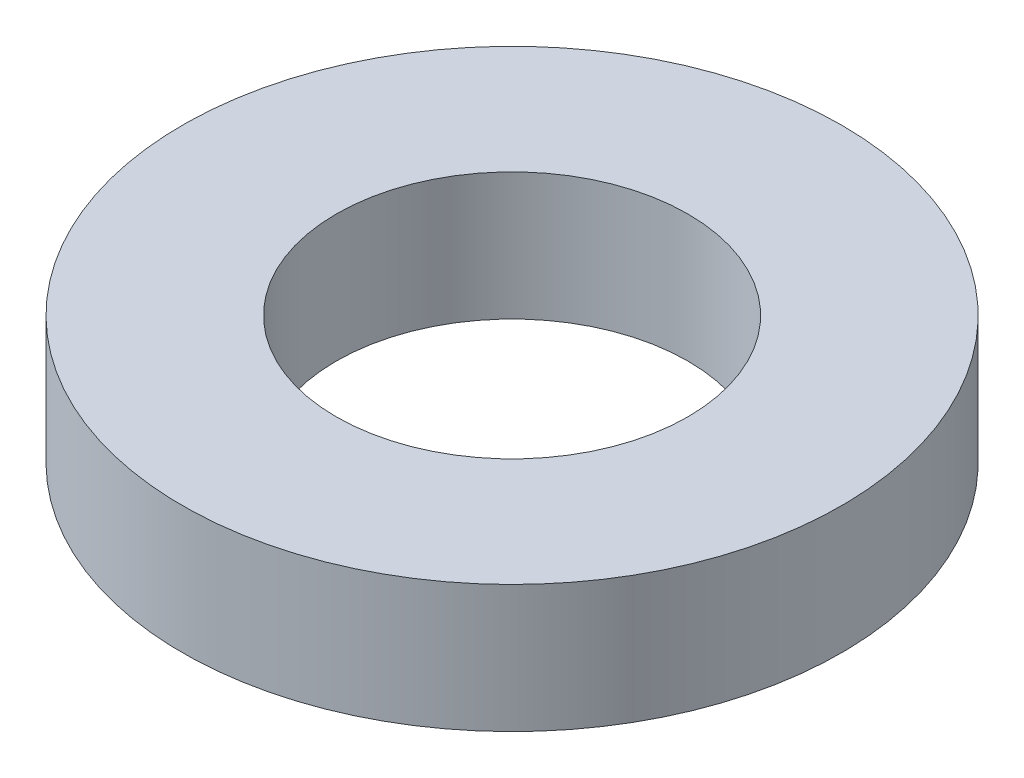
ISO-10303-21;
HEADER;
FILE_DESCRIPTION(('STEP AP214'),'2;1');
FILE_NAME('part.step','',(''),(''),'','','');
FILE_SCHEMA(('AUTOMOTIVE_DESIGN { 1 0 10303 214 1 1 1 1 }'));
ENDSEC;
DATA;
#1=APPLICATION_CONTEXT('core data for automotive mechanical design processes');
#2=APPLICATION_PROTOCOL_DEFINITION('international standard','automotive_design',2000,#1);
#3=PRODUCT_CONTEXT('',#1,'mechanical');
#4=PRODUCT('Part','Part','',(#3));
#5=PRODUCT_RELATED_PRODUCT_CATEGORY('part','',(#4));
#6=PRODUCT_DEFINITION_FORMATION('','',#4);
#7=PRODUCT_DEFINITION_CONTEXT('part definition',#1,'design');
#8=PRODUCT_DEFINITION('design','',#6,#7);
#9=PRODUCT_DEFINITION_SHAPE('','',#8);
#10=(LENGTH_UNIT() NAMED_UNIT(*) SI_UNIT(.MILLI.,.METRE.));
#11=(NAMED_UNIT(*) PLANE_ANGLE_UNIT() SI_UNIT($,.RADIAN.));
#12=(NAMED_UNIT(*) SI_UNIT($,.STERADIAN.) SOLID_ANGLE_UNIT());
#13=UNCERTAINTY_MEASURE_WITH_UNIT(LENGTH_MEASURE(1.E-05),#10,'distance_accuracy_value','');
#14=(GEOMETRIC_REPRESENTATION_CONTEXT(3) GLOBAL_UNCERTAINTY_ASSIGNED_CONTEXT((#13)) GLOBAL_UNIT_ASSIGNED_CONTEXT((#10,
#11,#12)) REPRESENTATION_CONTEXT('',''));
#15=CARTESIAN_POINT('',(0.,0.,0.));
#16=DIRECTION('',(0.,0.,1.));
#17=DIRECTION('',(1.,0.,0.));
#18=AXIS2_PLACEMENT_3D('',#15,#16,#17);
#19=CARTESIAN_POINT('',(0.,29.,0.));
#20=DIRECTION('',(0.,-1.,0.));
#21=DIRECTION('',(0.,0.,-1.));
#22=AXIS2_PLACEMENT_3D('',#19,#20,#21);
#23=CYLINDRICAL_SURFACE('',#22,75.);
#24=CARTESIAN_POINT('',(0.,29.,0.));
#25=DIRECTION('',(0.,1.,0.));
#26=DIRECTION('',(0.,0.,1.));
#27=AXIS2_PLACEMENT_3D('',#24,#25,#26);
#28=CIRCLE('',#27,75.);
#29=CARTESIAN_POINT('',(0.,29.,-75.));
#30=VERTEX_POINT('',#29);
#31=EDGE_CURVE('E10',#30,#30,#28,.T.);
#32=CARTESIAN_POINT('',(0.,0.,0.));
#33=DIRECTION('',(0.,1.,0.));
#34=DIRECTION('',(0.,0.,1.));
#35=AXIS2_PLACEMENT_3D('',#32,#33,#34);
#36=CIRCLE('',#35,75.);
#37=CARTESIAN_POINT('',(0.,0.,-75.));
#38=VERTEX_POINT('',#37);
#39=EDGE_CURVE('E37',#38,#38,#36,.T.);
#40=CARTESIAN_POINT('',(0.,29.,-75.));
#41=CARTESIAN_POINT('',(0.,28.6979166666667,-75.));
#42=CARTESIAN_POINT('',(0.,28.3958333333333,-75.));
#43=CARTESIAN_POINT('',(0.,27.7916666666667,-75.));
#44=CARTESIAN_POINT('',(0.,27.4895833333333,-75.));
#45=CARTESIAN_POINT('',(0.,26.8854166666667,-75.));
#46=CARTESIAN_POINT('',(0.,26.5833333333333,-75.));
#47=CARTESIAN_POINT('',(0.,25.9791666666667,-75.));
#48=CARTESIAN_POINT('',(0.,25.6770833333333,-75.));
#49=CARTESIAN_POINT('',(0.,25.0729166666667,-75.));
#50=CARTESIAN_POINT('',(0.,24.7708333333333,-75.));
#51=CARTESIAN_POINT('',(0.,24.1666666666667,-75.));
#52=CARTESIAN_POINT('',(0.,23.8645833333333,-75.));
#53=CARTESIAN_POINT('',(0.,23.2604166666667,-75.));
#54=CARTESIAN_POINT('',(0.,22.9583333333333,-75.));
#55=CARTESIAN_POINT('',(0.,22.3541666666667,-75.));
#56=CARTESIAN_POINT('',(0.,22.0520833333333,-75.));
#57=CARTESIAN_POINT('',(0.,21.4479166666667,-75.));
#58=CARTESIAN_POINT('',(0.,21.1458333333333,-75.));
#59=CARTESIAN_POINT('',(0.,20.5416666666667,-75.));
#60=CARTESIAN_POINT('',(0.,20.2395833333333,-75.));
#61=CARTESIAN_POINT('',(0.,19.6354166666667,-75.));
#62=CARTESIAN_POINT('',(0.,19.3333333333333,-75.));
#63=CARTESIAN_POINT('',(0.,18.7291666666667,-75.));
#64=CARTESIAN_POINT('',(0.,18.4270833333333,-75.));
#65=CARTESIAN_POINT('',(0.,17.8229166666667,-75.));
#66=CARTESIAN_POINT('',(0.,17.5208333333333,-75.));
#67=CARTESIAN_POINT('',(0.,16.9166666666667,-75.));
#68=CARTESIAN_POINT('',(0.,16.6145833333333,-75.));
#69=CARTESIAN_POINT('',(0.,16.0104166666667,-75.));
#70=CARTESIAN_POINT('',(0.,15.7083333333333,-75.));
#71=CARTESIAN_POINT('',(0.,15.1041666666667,-75.));
#72=CARTESIAN_POINT('',(0.,14.8020833333333,-75.));
#73=CARTESIAN_POINT('',(0.,14.1979166666667,-75.));
#74=CARTESIAN_POINT('',(0.,13.8958333333333,-75.));
#75=CARTESIAN_POINT('',(0.,13.2916666666667,-75.));
#76=CARTESIAN_POINT('',(0.,12.9895833333333,-75.));
#77=CARTESIAN_POINT('',(0.,12.3854166666667,-75.));
#78=CARTESIAN_POINT('',(0.,12.0833333333333,-75.));
#79=CARTESIAN_POINT('',(0.,11.4791666666667,-75.));
#80=CARTESIAN_POINT('',(0.,11.1770833333333,-75.));
#81=CARTESIAN_POINT('',(0.,10.5729166666667,-75.));
#82=CARTESIAN_POINT('',(0.,10.2708333333333,-75.));
#83=CARTESIAN_POINT('',(0.,9.66666666666667,-75.));
#84=CARTESIAN_POINT('',(0.,9.36458333333333,-75.));
#85=CARTESIAN_POINT('',(0.,8.76041666666667,-75.));
#86=CARTESIAN_POINT('',(0.,8.45833333333333,-75.));
#87=CARTESIAN_POINT('',(0.,7.85416666666667,-75.));
#88=CARTESIAN_POINT('',(0.,7.55208333333333,-75.));
#89=CARTESIAN_POINT('',(0.,6.94791666666667,-75.));
#90=CARTESIAN_POINT('',(0.,6.64583333333333,-75.));
#91=CARTESIAN_POINT('',(0.,6.04166666666667,-75.));
#92=CARTESIAN_POINT('',(0.,5.73958333333333,-75.));
#93=CARTESIAN_POINT('',(0.,5.13541666666667,-75.));
#94=CARTESIAN_POINT('',(0.,4.83333333333333,-75.));
#95=CARTESIAN_POINT('',(0.,4.22916666666667,-75.));
#96=CARTESIAN_POINT('',(0.,3.92708333333333,-75.));
#97=CARTESIAN_POINT('',(0.,3.32291666666667,-75.));
#98=CARTESIAN_POINT('',(0.,3.02083333333333,-75.));
#99=CARTESIAN_POINT('',(0.,2.41666666666667,-75.));
#100=CARTESIAN_POINT('',(0.,2.11458333333333,-75.));
#101=CARTESIAN_POINT('',(0.,1.51041666666667,-75.));
#102=CARTESIAN_POINT('',(0.,1.20833333333333,-75.));
#103=CARTESIAN_POINT('',(0.,0.604166666666667,-75.));
#104=CARTESIAN_POINT('',(0.,0.302083333333333,-75.));
#105=CARTESIAN_POINT('',(0.,0.,-75.));
#106=B_SPLINE_CURVE_WITH_KNOTS('',3,(#40,#41,#42,#43,#44,#45,#46,#47,#48,#49,#50,#51,#52,#53,
#54,#55,#56,#57,#58,#59,#60,#61,#62,#63,#64,#65,#66,#67,#68,#69,#70,#71,#72,#73,#74,#75,#76,#77,
#78,#79,#80,#81,#82,#83,#84,#85,#86,#87,#88,#89,#90,#91,#92,#93,#94,#95,#96,#97,#98,#99,#100,
#101,#102,#103,#104,#105),.UNSPECIFIED.,.F.,.F.,(4,2,2,2,2,2,2,2,2,2,2,2,2,2,2,2,2,2,2,2,2,2,2,
2,2,2,2,2,2,2,2,2,4),(0.,0.906250000000001,1.8125,2.71875,3.625,4.53125,5.4375,6.34375,7.25,
8.15625,9.0625,9.96875,10.875,11.78125,12.6875,13.59375,14.5,15.40625,16.3125,17.21875,18.125,
19.03125,19.9375,20.84375,21.75,22.65625,23.5625,24.46875,25.375,26.28125,27.1875,28.09375,29.),.UNSPECIFIED.);
#107=EDGE_CURVE('BSEAM40',#30,#38,#106,.T.);
#108=ORIENTED_EDGE('',*,*,#31,.F.);
#109=ORIENTED_EDGE('',*,*,#39,.T.);
#110=ORIENTED_EDGE('',*,*,#107,.T.);
#111=ORIENTED_EDGE('',*,*,#107,.F.);
#112=EDGE_LOOP('',(#108,#110,#109,#111));
#113=FACE_BOUND('',#112,.T.);
#114=ADVANCED_FACE('F40',(#113),#23,.T.);
#115=CARTESIAN_POINT('',(0.,29.,0.));
#116=DIRECTION('',(0.,1.,0.));
#117=DIRECTION('',(0.,0.,1.));
#118=AXIS2_PLACEMENT_3D('',#115,#116,#117);
#119=PLANE('',#118);
#120=CARTESIAN_POINT('',(0.,29.,0.));
#121=DIRECTION('',(0.,1.,0.));
#122=DIRECTION('',(0.,0.,1.));
#123=AXIS2_PLACEMENT_3D('',#120,#121,#122);
#124=CIRCLE('',#123,40.);
#125=CARTESIAN_POINT('',(0.,29.,-40.));
#126=VERTEX_POINT('',#125);
#127=EDGE_CURVE('E50',#126,#126,#124,.T.);
#128=ORIENTED_EDGE('',*,*,#127,.F.);
#129=EDGE_LOOP('',(#128));
#130=FACE_BOUND('',#129,.T.);
#131=ORIENTED_EDGE('',*,*,#31,.T.);
#132=EDGE_LOOP('',(#131));
#133=FACE_BOUND('',#132,.T.);
#134=ADVANCED_FACE('F59',(#130,#133),#119,.T.);
#135=CARTESIAN_POINT('',(0.,0.,0.));
#136=DIRECTION('',(0.,1.,0.));
#137=DIRECTION('',(0.,0.,1.));
#138=AXIS2_PLACEMENT_3D('',#135,#136,#137);
#139=PLANE('',#138);
#140=CARTESIAN_POINT('',(0.,0.,0.));
#141=DIRECTION('',(0.,1.,0.));
#142=DIRECTION('',(0.,0.,1.));
#143=AXIS2_PLACEMENT_3D('',#140,#141,#142);
#144=CIRCLE('',#143,40.);
#145=CARTESIAN_POINT('',(0.,0.,-40.));
#146=VERTEX_POINT('',#145);
#147=EDGE_CURVE('E47',#146,#146,#144,.T.);
#148=ORIENTED_EDGE('',*,*,#147,.T.);
#149=EDGE_LOOP('',(#148));
#150=FACE_BOUND('',#149,.T.);
#151=ORIENTED_EDGE('',*,*,#39,.F.);
#152=EDGE_LOOP('',(#151));
#153=FACE_BOUND('',#152,.T.);
#154=ADVANCED_FACE('F58',(#150,#153),#139,.F.);
#155=CARTESIAN_POINT('',(0.,29.,0.));
#156=DIRECTION('',(0.,-1.,0.));
#157=DIRECTION('',(0.,0.,-1.));
#158=AXIS2_PLACEMENT_3D('',#155,#156,#157);
#159=CYLINDRICAL_SURFACE('',#158,40.);
#160=CARTESIAN_POINT('',(0.,29.,-40.));
#161=CARTESIAN_POINT('',(0.,28.6979166666667,-40.));
#162=CARTESIAN_POINT('',(0.,28.3958333333333,-40.));
#163=CARTESIAN_POINT('',(0.,27.7916666666667,-40.));
#164=CARTESIAN_POINT('',(0.,27.4895833333333,-40.));
#165=CARTESIAN_POINT('',(0.,26.8854166666667,-40.));
#166=CARTESIAN_POINT('',(0.,26.5833333333333,-40.));
#167=CARTESIAN_POINT('',(0.,25.9791666666667,-40.));
#168=CARTESIAN_POINT('',(0.,25.6770833333333,-40.));
#169=CARTESIAN_POINT('',(0.,25.0729166666667,-40.));
#170=CARTESIAN_POINT('',(0.,24.7708333333333,-40.));
#171=CARTESIAN_POINT('',(0.,24.1666666666667,-40.));
#172=CARTESIAN_POINT('',(0.,23.8645833333333,-40.));
#173=CARTESIAN_POINT('',(0.,23.2604166666667,-40.));
#174=CARTESIAN_POINT('',(0.,22.9583333333333,-40.));
#175=CARTESIAN_POINT('',(0.,22.3541666666667,-40.));
#176=CARTESIAN_POINT('',(0.,22.0520833333333,-40.));
#177=CARTESIAN_POINT('',(0.,21.4479166666667,-40.));
#178=CARTESIAN_POINT('',(0.,21.1458333333333,-40.));
#179=CARTESIAN_POINT('',(0.,20.5416666666667,-40.));
#180=CARTESIAN_POINT('',(0.,20.2395833333333,-40.));
#181=CARTESIAN_POINT('',(0.,19.6354166666667,-40.));
#182=CARTESIAN_POINT('',(0.,19.3333333333333,-40.));
#183=CARTESIAN_POINT('',(0.,18.7291666666667,-40.));
#184=CARTESIAN_POINT('',(0.,18.4270833333333,-40.));
#185=CARTESIAN_POINT('',(0.,17.8229166666667,-40.));
#186=CARTESIAN_POINT('',(0.,17.5208333333333,-40.));
#187=CARTESIAN_POINT('',(0.,16.9166666666667,-40.));
#188=CARTESIAN_POINT('',(0.,16.6145833333333,-40.));
#189=CARTESIAN_POINT('',(0.,16.0104166666667,-40.));
#190=CARTESIAN_POINT('',(0.,15.7083333333333,-40.));
#191=CARTESIAN_POINT('',(0.,15.1041666666667,-40.));
#192=CARTESIAN_POINT('',(0.,14.8020833333333,-40.));
#193=CARTESIAN_POINT('',(0.,14.1979166666667,-40.));
#194=CARTESIAN_POINT('',(0.,13.8958333333333,-40.));
#195=CARTESIAN_POINT('',(0.,13.2916666666667,-40.));
#196=CARTESIAN_POINT('',(0.,12.9895833333333,-40.));
#197=CARTESIAN_POINT('',(0.,12.3854166666667,-40.));
#198=CARTESIAN_POINT('',(0.,12.0833333333333,-40.));
#199=CARTESIAN_POINT('',(0.,11.4791666666667,-40.));
#200=CARTESIAN_POINT('',(0.,11.1770833333333,-40.));
#201=CARTESIAN_POINT('',(0.,10.5729166666667,-40.));
#202=CARTESIAN_POINT('',(0.,10.2708333333333,-40.));
#203=CARTESIAN_POINT('',(0.,9.66666666666667,-40.));
#204=CARTESIAN_POINT('',(0.,9.36458333333333,-40.));
#205=CARTESIAN_POINT('',(0.,8.76041666666667,-40.));
#206=CARTESIAN_POINT('',(0.,8.45833333333333,-40.));
#207=CARTESIAN_POINT('',(0.,7.85416666666667,-40.));
#208=CARTESIAN_POINT('',(0.,7.55208333333333,-40.));
#209=CARTESIAN_POINT('',(0.,6.94791666666667,-40.));
#210=CARTESIAN_POINT('',(0.,6.64583333333333,-40.));
#211=CARTESIAN_POINT('',(0.,6.04166666666667,-40.));
#212=CARTESIAN_POINT('',(0.,5.73958333333333,-40.));
#213=CARTESIAN_POINT('',(0.,5.13541666666667,-40.));
#214=CARTESIAN_POINT('',(0.,4.83333333333333,-40.));
#215=CARTESIAN_POINT('',(0.,4.22916666666667,-40.));
#216=CARTESIAN_POINT('',(0.,3.92708333333333,-40.));
#217=CARTESIAN_POINT('',(0.,3.32291666666667,-40.));
#218=CARTESIAN_POINT('',(0.,3.02083333333333,-40.));
#219=CARTESIAN_POINT('',(0.,2.41666666666667,-40.));
#220=CARTESIAN_POINT('',(0.,2.11458333333333,-40.));
#221=CARTESIAN_POINT('',(0.,1.51041666666667,-40.));
#222=CARTESIAN_POINT('',(0.,1.20833333333333,-40.));
#223=CARTESIAN_POINT('',(0.,0.604166666666667,-40.));
#224=CARTESIAN_POINT('',(0.,0.302083333333333,-40.));
#225=CARTESIAN_POINT('',(0.,0.,-40.));
#226=B_SPLINE_CURVE_WITH_KNOTS('',3,(#160,#161,#162,#163,#164,#165,#166,#167,#168,#169,#170,
#171,#172,#173,#174,#175,#176,#177,#178,#179,#180,#181,#182,#183,#184,#185,#186,#187,#188,#189,
#190,#191,#192,#193,#194,#195,#196,#197,#198,#199,#200,#201,#202,#203,#204,#205,#206,#207,#208,
#209,#210,#211,#212,#213,#214,#215,#216,#217,#218,#219,#220,#221,#222,#223,#224,#225),
.UNSPECIFIED.,.F.,.F.,(4,2,2,2,2,2,2,2,2,2,2,2,2,2,2,2,2,2,2,2,2,2,2,2,2,2,2,2,2,2,2,2,4),(0.,
0.906249999999997,1.8125,2.71875,3.625,4.53125,5.4375,6.34375,7.25,8.15625,9.0625,9.96875,
10.875,11.78125,12.6875,13.59375,14.5,15.40625,16.3125,17.21875,18.125,19.03125,19.9375,
20.84375,21.75,22.65625,23.5625,24.46875,25.375,26.28125,27.1875,28.09375,29.),.UNSPECIFIED.);
#227=EDGE_CURVE('BSEAM54',#126,#146,#226,.T.);
#228=ORIENTED_EDGE('',*,*,#127,.T.);
#229=ORIENTED_EDGE('',*,*,#147,.F.);
#230=ORIENTED_EDGE('',*,*,#227,.T.);
#231=ORIENTED_EDGE('',*,*,#227,.F.);
#232=EDGE_LOOP('',(#228,#230,#229,#231));
#233=FACE_BOUND('',#232,.T.);
#234=ADVANCED_FACE('F54',(#233),#159,.F.);
#235=CLOSED_SHELL('',(#114,#134,#154,#234));
#236=MANIFOLD_SOLID_BREP('B2',#235);
#237=ADVANCED_BREP_SHAPE_REPRESENTATION('',(#18,#236),#14);
#238=SHAPE_DEFINITION_REPRESENTATION(#9,#237);
ENDSEC;
END-ISO-10303-21;
